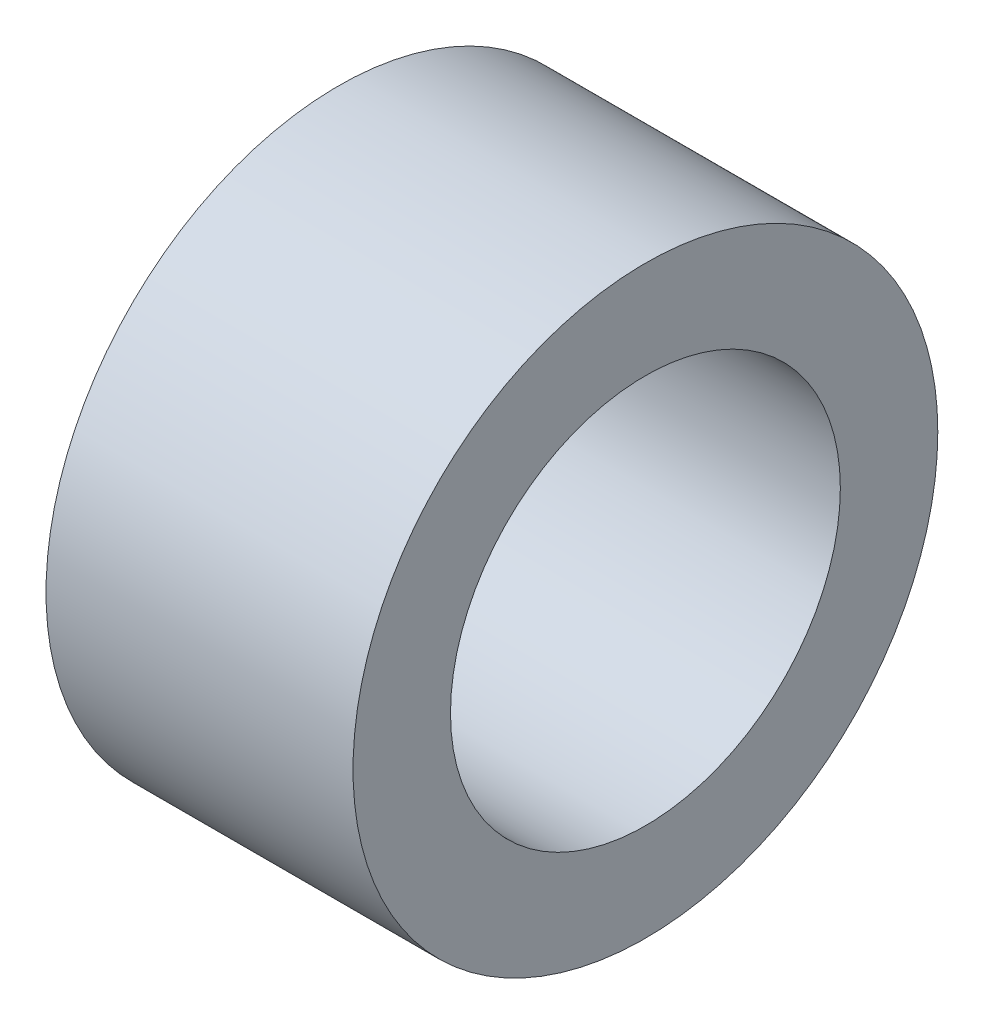
ISO-10303-21;
HEADER;
FILE_DESCRIPTION(('STEP AP214'),'2;1');
FILE_NAME('part.step','',(''),(''),'','','');
FILE_SCHEMA(('AUTOMOTIVE_DESIGN { 1 0 10303 214 1 1 1 1 }'));
ENDSEC;
DATA;
#1=APPLICATION_CONTEXT('core data for automotive mechanical design processes');
#2=APPLICATION_PROTOCOL_DEFINITION('international standard','automotive_design',2000,#1);
#3=PRODUCT_CONTEXT('',#1,'mechanical');
#4=PRODUCT('Part','Part','',(#3));
#5=PRODUCT_RELATED_PRODUCT_CATEGORY('part','',(#4));
#6=PRODUCT_DEFINITION_FORMATION('','',#4);
#7=PRODUCT_DEFINITION_CONTEXT('part definition',#1,'design');
#8=PRODUCT_DEFINITION('design','',#6,#7);
#9=PRODUCT_DEFINITION_SHAPE('','',#8);
#10=(LENGTH_UNIT() NAMED_UNIT(*) SI_UNIT(.MILLI.,.METRE.));
#11=(NAMED_UNIT(*) PLANE_ANGLE_UNIT() SI_UNIT($,.RADIAN.));
#12=(NAMED_UNIT(*) SI_UNIT($,.STERADIAN.) SOLID_ANGLE_UNIT());
#13=UNCERTAINTY_MEASURE_WITH_UNIT(LENGTH_MEASURE(1.E-05),#10,'distance_accuracy_value','');
#14=(GEOMETRIC_REPRESENTATION_CONTEXT(3) GLOBAL_UNCERTAINTY_ASSIGNED_CONTEXT((#13)) GLOBAL_UNIT_ASSIGNED_CONTEXT((#10,
#11,#12)) REPRESENTATION_CONTEXT('',''));
#15=CARTESIAN_POINT('',(0.,0.,0.));
#16=DIRECTION('',(0.,0.,1.));
#17=DIRECTION('',(1.,0.,0.));
#18=AXIS2_PLACEMENT_3D('',#15,#16,#17);
#19=CARTESIAN_POINT('',(-6.3,3.56105355394053,19.0770726103956));
#20=DIRECTION('',(1.,0.,0.));
#21=DIRECTION('',(0.,0.,-1.));
#22=AXIS2_PLACEMENT_3D('',#19,#20,#21);
#23=CYLINDRICAL_SURFACE('',#22,12.);
#24=CARTESIAN_POINT('',(-6.3,3.56105355394053,19.0770726103956));
#25=DIRECTION('',(1.,0.,0.));
#26=DIRECTION('',(0.,0.,-1.));
#27=AXIS2_PLACEMENT_3D('',#24,#25,#26);
#28=CIRCLE('',#27,12.);
#29=CARTESIAN_POINT('',(-6.3,3.56105355394053,7.07707261039565));
#30=VERTEX_POINT('',#29);
#31=EDGE_CURVE('E11',#30,#30,#28,.T.);
#32=ORIENTED_EDGE('',*,*,#31,.T.);
#33=EDGE_LOOP('',(#32));
#34=FACE_BOUND('',#33,.T.);
#35=CARTESIAN_POINT('',(6.3,3.56105355394053,19.0770726103956));
#36=DIRECTION('',(1.,0.,0.));
#37=DIRECTION('',(0.,0.,-1.));
#38=AXIS2_PLACEMENT_3D('',#35,#36,#37);
#39=CIRCLE('',#38,12.);
#40=CARTESIAN_POINT('',(6.3,3.56105355394053,7.07707261039565));
#41=VERTEX_POINT('',#40);
#42=EDGE_CURVE('E57',#41,#41,#39,.T.);
#43=ORIENTED_EDGE('',*,*,#42,.F.);
#44=EDGE_LOOP('',(#43));
#45=FACE_BOUND('',#44,.T.);
#46=ADVANCED_FACE('F47',(#34,#45),#23,.T.);
#47=CARTESIAN_POINT('',(-6.3,3.56105355394053,19.0770726103956));
#48=DIRECTION('',(1.,0.,0.));
#49=DIRECTION('',(0.,0.,-1.));
#50=AXIS2_PLACEMENT_3D('',#47,#48,#49);
#51=PLANE('',#50);
#52=CARTESIAN_POINT('',(-6.3,3.56105355394053,19.0770726103956));
#53=DIRECTION('',(1.,0.,0.));
#54=DIRECTION('',(0.,0.,-1.));
#55=AXIS2_PLACEMENT_3D('',#52,#53,#54);
#56=CIRCLE('',#55,8.);
#57=CARTESIAN_POINT('',(-6.3,3.56105355394053,11.0770726103956));
#58=VERTEX_POINT('',#57);
#59=EDGE_CURVE('E53',#58,#58,#56,.T.);
#60=ORIENTED_EDGE('',*,*,#59,.T.);
#61=EDGE_LOOP('',(#60));
#62=FACE_BOUND('',#61,.T.);
#63=ORIENTED_EDGE('',*,*,#31,.F.);
#64=EDGE_LOOP('',(#63));
#65=FACE_BOUND('',#64,.T.);
#66=ADVANCED_FACE('F76',(#62,#65),#51,.F.);
#67=CARTESIAN_POINT('',(-6.3,3.56105355394053,19.0770726103956));
#68=DIRECTION('',(1.,0.,0.));
#69=DIRECTION('',(0.,0.,-1.));
#70=AXIS2_PLACEMENT_3D('',#67,#68,#69);
#71=CYLINDRICAL_SURFACE('',#70,8.);
#72=ORIENTED_EDGE('',*,*,#59,.F.);
#73=EDGE_LOOP('',(#72));
#74=FACE_BOUND('',#73,.T.);
#75=CARTESIAN_POINT('',(6.3,3.56105355394053,19.0770726103956));
#76=DIRECTION('',(1.,0.,0.));
#77=DIRECTION('',(0.,0.,-1.));
#78=AXIS2_PLACEMENT_3D('',#75,#76,#77);
#79=CIRCLE('',#78,8.);
#80=CARTESIAN_POINT('',(6.3,3.56105355394053,11.0770726103956));
#81=VERTEX_POINT('',#80);
#82=EDGE_CURVE('E61',#81,#81,#79,.T.);
#83=ORIENTED_EDGE('',*,*,#82,.T.);
#84=EDGE_LOOP('',(#83));
#85=FACE_BOUND('',#84,.T.);
#86=ADVANCED_FACE('F67',(#74,#85),#71,.F.);
#87=CARTESIAN_POINT('',(6.3,3.56105355394053,19.0770726103956));
#88=DIRECTION('',(1.,0.,0.));
#89=DIRECTION('',(0.,0.,-1.));
#90=AXIS2_PLACEMENT_3D('',#87,#88,#89);
#91=PLANE('',#90);
#92=ORIENTED_EDGE('',*,*,#42,.T.);
#93=EDGE_LOOP('',(#92));
#94=FACE_BOUND('',#93,.T.);
#95=ORIENTED_EDGE('',*,*,#82,.F.);
#96=EDGE_LOOP('',(#95));
#97=FACE_BOUND('',#96,.T.);
#98=ADVANCED_FACE('F69',(#94,#97),#91,.T.);
#99=CLOSED_SHELL('',(#46,#66,#86,#98));
#100=MANIFOLD_SOLID_BREP('B2',#99);
#101=ADVANCED_BREP_SHAPE_REPRESENTATION('',(#18,#100),#14);
#102=SHAPE_DEFINITION_REPRESENTATION(#9,#101);
ENDSEC;
END-ISO-10303-21;
